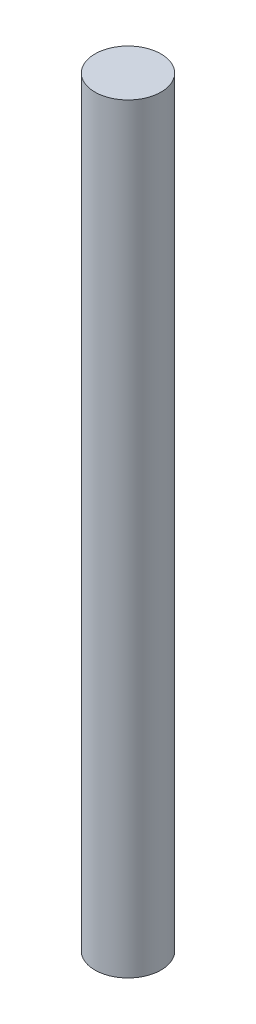
ISO-10303-21;
HEADER;
FILE_DESCRIPTION(('STEP AP214'),'2;1');
FILE_NAME('part.step','',(''),(''),'','','');
FILE_SCHEMA(('AUTOMOTIVE_DESIGN { 1 0 10303 214 1 1 1 1 }'));
ENDSEC;
DATA;
#1=APPLICATION_CONTEXT('core data for automotive mechanical design processes');
#2=APPLICATION_PROTOCOL_DEFINITION('international standard','automotive_design',2000,#1);
#3=PRODUCT_CONTEXT('',#1,'mechanical');
#4=PRODUCT('Part','Part','',(#3));
#5=PRODUCT_RELATED_PRODUCT_CATEGORY('part','',(#4));
#6=PRODUCT_DEFINITION_FORMATION('','',#4);
#7=PRODUCT_DEFINITION_CONTEXT('part definition',#1,'design');
#8=PRODUCT_DEFINITION('design','',#6,#7);
#9=PRODUCT_DEFINITION_SHAPE('','',#8);
#10=(LENGTH_UNIT() NAMED_UNIT(*) SI_UNIT(.MILLI.,.METRE.));
#11=(NAMED_UNIT(*) PLANE_ANGLE_UNIT() SI_UNIT($,.RADIAN.));
#12=(NAMED_UNIT(*) SI_UNIT($,.STERADIAN.) SOLID_ANGLE_UNIT());
#13=UNCERTAINTY_MEASURE_WITH_UNIT(LENGTH_MEASURE(1.E-05),#10,'distance_accuracy_value','');
#14=(GEOMETRIC_REPRESENTATION_CONTEXT(3) GLOBAL_UNCERTAINTY_ASSIGNED_CONTEXT((#13)) GLOBAL_UNIT_ASSIGNED_CONTEXT((#10,
#11,#12)) REPRESENTATION_CONTEXT('',''));
#15=CARTESIAN_POINT('',(0.,0.,0.));
#16=DIRECTION('',(0.,0.,1.));
#17=DIRECTION('',(1.,0.,0.));
#18=AXIS2_PLACEMENT_3D('',#15,#16,#17);
#19=CARTESIAN_POINT('',(0.,23.,0.));
#20=DIRECTION('',(0.,-1.,0.));
#21=DIRECTION('',(0.,0.,-1.));
#22=AXIS2_PLACEMENT_3D('',#19,#20,#21);
#23=CYLINDRICAL_SURFACE('',#22,1.);
#24=CARTESIAN_POINT('',(0.,23.,0.));
#25=DIRECTION('',(0.,1.,0.));
#26=DIRECTION('',(0.,0.,1.));
#27=AXIS2_PLACEMENT_3D('',#24,#25,#26);
#28=CIRCLE('',#27,1.);
#29=CARTESIAN_POINT('',(0.,23.,1.));
#30=VERTEX_POINT('',#29);
#31=EDGE_CURVE('E10',#30,#30,#28,.T.);
#32=ORIENTED_EDGE('',*,*,#31,.F.);
#33=EDGE_LOOP('',(#32));
#34=FACE_BOUND('',#33,.T.);
#35=CARTESIAN_POINT('',(0.,0.,0.));
#36=DIRECTION('',(0.,1.,0.));
#37=DIRECTION('',(0.,0.,1.));
#38=AXIS2_PLACEMENT_3D('',#35,#36,#37);
#39=CIRCLE('',#38,1.);
#40=CARTESIAN_POINT('',(0.,0.,1.));
#41=VERTEX_POINT('',#40);
#42=EDGE_CURVE('E40',#41,#41,#39,.T.);
#43=ORIENTED_EDGE('',*,*,#42,.T.);
#44=EDGE_LOOP('',(#43));
#45=FACE_BOUND('',#44,.T.);
#46=ADVANCED_FACE('F37',(#34,#45),#23,.T.);
#47=CARTESIAN_POINT('',(0.,23.,0.));
#48=DIRECTION('',(0.,1.,0.));
#49=DIRECTION('',(0.,0.,1.));
#50=AXIS2_PLACEMENT_3D('',#47,#48,#49);
#51=PLANE('',#50);
#52=ORIENTED_EDGE('',*,*,#31,.T.);
#53=EDGE_LOOP('',(#52));
#54=FACE_BOUND('',#53,.T.);
#55=ADVANCED_FACE('F54',(#54),#51,.T.);
#56=CARTESIAN_POINT('',(0.,0.,0.));
#57=DIRECTION('',(0.,1.,0.));
#58=DIRECTION('',(0.,0.,1.));
#59=AXIS2_PLACEMENT_3D('',#56,#57,#58);
#60=PLANE('',#59);
#61=ORIENTED_EDGE('',*,*,#42,.F.);
#62=EDGE_LOOP('',(#61));
#63=FACE_BOUND('',#62,.T.);
#64=ADVANCED_FACE('F52',(#63),#60,.F.);
#65=CLOSED_SHELL('',(#46,#55,#64));
#66=MANIFOLD_SOLID_BREP('B2',#65);
#67=ADVANCED_BREP_SHAPE_REPRESENTATION('',(#18,#66),#14);
#68=SHAPE_DEFINITION_REPRESENTATION(#9,#67);
ENDSEC;
END-ISO-10303-21;
